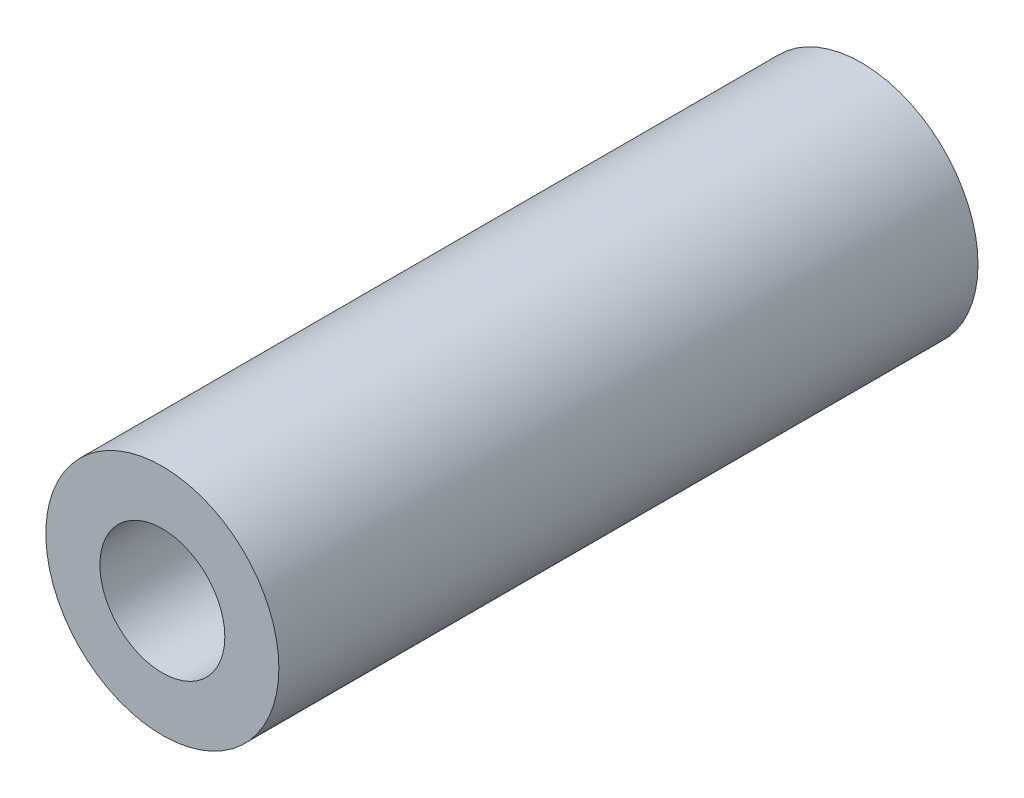
ISO-10303-21;
HEADER;
FILE_DESCRIPTION(('STEP AP214'),'2;1');
FILE_NAME('part.step','',(''),(''),'','','');
FILE_SCHEMA(('AUTOMOTIVE_DESIGN { 1 0 10303 214 1 1 1 1 }'));
ENDSEC;
DATA;
#1=APPLICATION_CONTEXT('core data for automotive mechanical design processes');
#2=APPLICATION_PROTOCOL_DEFINITION('international standard','automotive_design',2000,#1);
#3=PRODUCT_CONTEXT('',#1,'mechanical');
#4=PRODUCT('Part','Part','',(#3));
#5=PRODUCT_RELATED_PRODUCT_CATEGORY('part','',(#4));
#6=PRODUCT_DEFINITION_FORMATION('','',#4);
#7=PRODUCT_DEFINITION_CONTEXT('part definition',#1,'design');
#8=PRODUCT_DEFINITION('design','',#6,#7);
#9=PRODUCT_DEFINITION_SHAPE('','',#8);
#10=(LENGTH_UNIT() NAMED_UNIT(*) SI_UNIT(.MILLI.,.METRE.));
#11=(NAMED_UNIT(*) PLANE_ANGLE_UNIT() SI_UNIT($,.RADIAN.));
#12=(NAMED_UNIT(*) SI_UNIT($,.STERADIAN.) SOLID_ANGLE_UNIT());
#13=UNCERTAINTY_MEASURE_WITH_UNIT(LENGTH_MEASURE(1.E-05),#10,'distance_accuracy_value','');
#14=(GEOMETRIC_REPRESENTATION_CONTEXT(3) GLOBAL_UNCERTAINTY_ASSIGNED_CONTEXT((#13)) GLOBAL_UNIT_ASSIGNED_CONTEXT((#10,
#11,#12)) REPRESENTATION_CONTEXT('',''));
#15=CARTESIAN_POINT('',(0.,0.,0.));
#16=DIRECTION('',(0.,0.,1.));
#17=DIRECTION('',(1.,0.,0.));
#18=AXIS2_PLACEMENT_3D('',#15,#16,#17);
#19=CARTESIAN_POINT('',(0.,0.,28.575));
#20=DIRECTION('',(0.,0.,1.));
#21=DIRECTION('',(1.,0.,0.));
#22=AXIS2_PLACEMENT_3D('',#19,#20,#21);
#23=PLANE('',#22);
#24=CARTESIAN_POINT('',(0.,0.,28.575));
#25=DIRECTION('',(0.,0.,1.));
#26=DIRECTION('',(1.,0.,0.));
#27=AXIS2_PLACEMENT_3D('',#24,#25,#26);
#28=CIRCLE('',#27,4.7625);
#29=CARTESIAN_POINT('',(4.7625,0.,28.575));
#30=VERTEX_POINT('',#29);
#31=EDGE_CURVE('E10',#30,#30,#28,.T.);
#32=ORIENTED_EDGE('',*,*,#31,.T.);
#33=EDGE_LOOP('',(#32));
#34=FACE_BOUND('',#33,.T.);
#35=CARTESIAN_POINT('',(0.,0.,28.575));
#36=DIRECTION('',(0.,0.,1.));
#37=DIRECTION('',(1.,0.,0.));
#38=AXIS2_PLACEMENT_3D('',#35,#36,#37);
#39=CIRCLE('',#38,2.5527);
#40=CARTESIAN_POINT('',(2.5527,0.,28.575));
#41=VERTEX_POINT('',#40);
#42=EDGE_CURVE('E42',#41,#41,#39,.T.);
#43=ORIENTED_EDGE('',*,*,#42,.F.);
#44=EDGE_LOOP('',(#43));
#45=FACE_BOUND('',#44,.T.);
#46=ADVANCED_FACE('F31',(#34,#45),#23,.T.);
#47=CARTESIAN_POINT('',(0.,0.,0.));
#48=DIRECTION('',(0.,0.,1.));
#49=DIRECTION('',(1.,0.,0.));
#50=AXIS2_PLACEMENT_3D('',#47,#48,#49);
#51=PLANE('',#50);
#52=CARTESIAN_POINT('',(0.,0.,0.));
#53=DIRECTION('',(0.,0.,1.));
#54=DIRECTION('',(1.,0.,0.));
#55=AXIS2_PLACEMENT_3D('',#52,#53,#54);
#56=CIRCLE('',#55,4.7625);
#57=CARTESIAN_POINT('',(4.7625,0.,0.));
#58=VERTEX_POINT('',#57);
#59=EDGE_CURVE('E35',#58,#58,#56,.T.);
#60=ORIENTED_EDGE('',*,*,#59,.F.);
#61=EDGE_LOOP('',(#60));
#62=FACE_BOUND('',#61,.T.);
#63=CARTESIAN_POINT('',(0.,0.,0.));
#64=DIRECTION('',(0.,0.,1.));
#65=DIRECTION('',(1.,0.,0.));
#66=AXIS2_PLACEMENT_3D('',#63,#64,#65);
#67=CIRCLE('',#66,2.5527);
#68=CARTESIAN_POINT('',(2.5527,0.,0.));
#69=VERTEX_POINT('',#68);
#70=EDGE_CURVE('E44',#69,#69,#67,.T.);
#71=ORIENTED_EDGE('',*,*,#70,.T.);
#72=EDGE_LOOP('',(#71));
#73=FACE_BOUND('',#72,.T.);
#74=ADVANCED_FACE('F54',(#62,#73),#51,.F.);
#75=CARTESIAN_POINT('',(0.,0.,28.575));
#76=DIRECTION('',(0.,0.,-1.));
#77=DIRECTION('',(-1.,0.,0.));
#78=AXIS2_PLACEMENT_3D('',#75,#76,#77);
#79=CYLINDRICAL_SURFACE('',#78,4.7625);
#80=ORIENTED_EDGE('',*,*,#31,.F.);
#81=EDGE_LOOP('',(#80));
#82=FACE_BOUND('',#81,.T.);
#83=ORIENTED_EDGE('',*,*,#59,.T.);
#84=EDGE_LOOP('',(#83));
#85=FACE_BOUND('',#84,.T.);
#86=ADVANCED_FACE('F33',(#82,#85),#79,.T.);
#87=CARTESIAN_POINT('',(0.,0.,28.575));
#88=DIRECTION('',(0.,0.,-1.));
#89=DIRECTION('',(-1.,0.,0.));
#90=AXIS2_PLACEMENT_3D('',#87,#88,#89);
#91=CYLINDRICAL_SURFACE('',#90,2.5527);
#92=ORIENTED_EDGE('',*,*,#42,.T.);
#93=EDGE_LOOP('',(#92));
#94=FACE_BOUND('',#93,.T.);
#95=ORIENTED_EDGE('',*,*,#70,.F.);
#96=EDGE_LOOP('',(#95));
#97=FACE_BOUND('',#96,.T.);
#98=ADVANCED_FACE('F50',(#94,#97),#91,.F.);
#99=CLOSED_SHELL('',(#46,#74,#86,#98));
#100=MANIFOLD_SOLID_BREP('B2',#99);
#101=ADVANCED_BREP_SHAPE_REPRESENTATION('',(#18,#100),#14);
#102=SHAPE_DEFINITION_REPRESENTATION(#9,#101);
ENDSEC;
END-ISO-10303-21;
